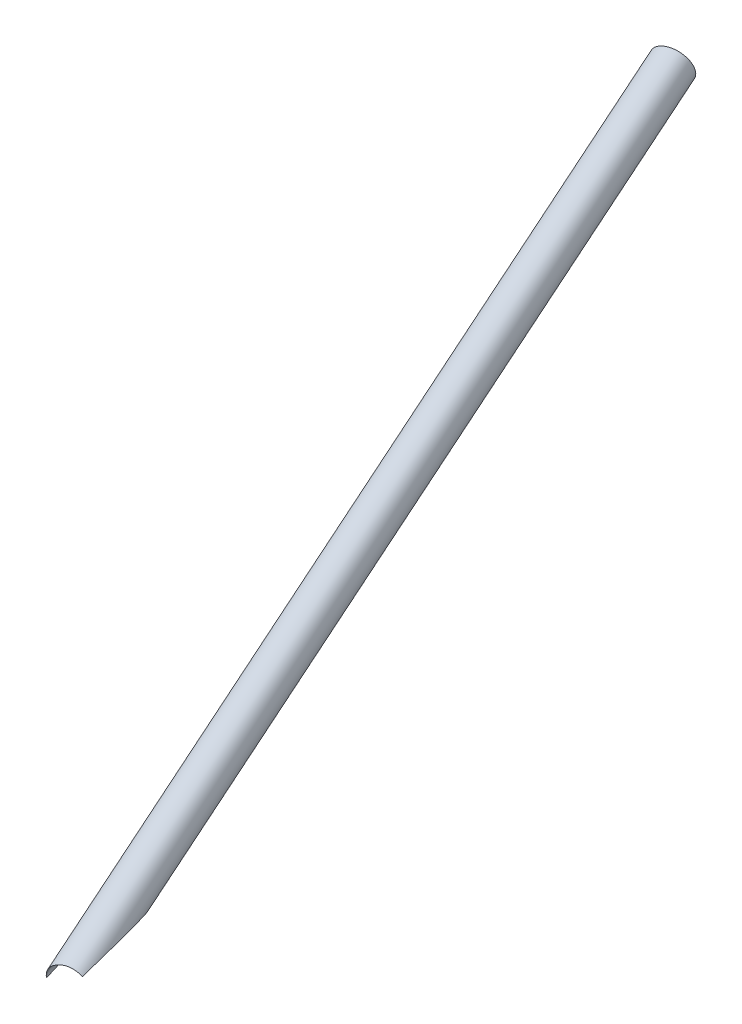
ISO-10303-21;
HEADER;
FILE_DESCRIPTION(('STEP AP214'),'2;1');
FILE_NAME('part.step','',(''),(''),'','','');
FILE_SCHEMA(('AUTOMOTIVE_DESIGN { 1 0 10303 214 1 1 1 1 }'));
ENDSEC;
DATA;
#1=APPLICATION_CONTEXT('core data for automotive mechanical design processes');
#2=APPLICATION_PROTOCOL_DEFINITION('international standard','automotive_design',2000,#1);
#3=PRODUCT_CONTEXT('',#1,'mechanical');
#4=PRODUCT('Part','Part','',(#3));
#5=PRODUCT_RELATED_PRODUCT_CATEGORY('part','',(#4));
#6=PRODUCT_DEFINITION_FORMATION('','',#4);
#7=PRODUCT_DEFINITION_CONTEXT('part definition',#1,'design');
#8=PRODUCT_DEFINITION('design','',#6,#7);
#9=PRODUCT_DEFINITION_SHAPE('','',#8);
#10=(LENGTH_UNIT() NAMED_UNIT(*) SI_UNIT(.MILLI.,.METRE.));
#11=(NAMED_UNIT(*) PLANE_ANGLE_UNIT() SI_UNIT($,.RADIAN.));
#12=(NAMED_UNIT(*) SI_UNIT($,.STERADIAN.) SOLID_ANGLE_UNIT());
#13=UNCERTAINTY_MEASURE_WITH_UNIT(LENGTH_MEASURE(1.E-05),#10,'distance_accuracy_value','');
#14=(GEOMETRIC_REPRESENTATION_CONTEXT(3) GLOBAL_UNCERTAINTY_ASSIGNED_CONTEXT((#13)) GLOBAL_UNIT_ASSIGNED_CONTEXT((#10,
#11,#12)) REPRESENTATION_CONTEXT('',''));
#15=CARTESIAN_POINT('',(0.,0.,0.));
#16=DIRECTION('',(0.,0.,1.));
#17=DIRECTION('',(1.,0.,0.));
#18=AXIS2_PLACEMENT_3D('',#15,#16,#17);
#19=CARTESIAN_POINT('',(-73.999999999997,1.84574577843932E-12,457.2));
#20=DIRECTION('',(0.,0.,-1.));
#21=DIRECTION('',(-1.,0.,0.));
#22=AXIS2_PLACEMENT_3D('',#19,#20,#21);
#23=CYLINDRICAL_SURFACE('',#22,9.52500000000001);
#24=CARTESIAN_POINT('',(-73.999999999997,1.85962356624714E-12,457.2));
#25=DIRECTION('',(0.863745042896464,0.478942715409445,-0.156711123498025));
#26=DIRECTION('',(0.137051802029359,0.0759946036802524,0.987644482479392));
#27=AXIS2_PLACEMENT_3D('',#24,#25,#26);
#28=ELLIPSE('',#27,60.7806248043446,9.525);
#29=CARTESIAN_POINT('',(-83.1702232239548,2.57538948953399,414.527401735599));
#30=VERTEX_POINT('',#29);
#31=CARTESIAN_POINT('',(-82.711415711536,3.85186465244711,420.957393255547));
#32=VERTEX_POINT('',#31);
#33=EDGE_CURVE('E11',#30,#32,#28,.T.);
#34=ORIENTED_EDGE('',*,*,#33,.F.);
#35=CARTESIAN_POINT('',(-73.999999999997,1.83186799063151E-12,457.2));
#36=DIRECTION('',(-0.705998161317946,0.681452623691267,0.192844284022027));
#37=DIRECTION('',(-0.138752175290532,0.133928158846875,-0.981229372837988));
#38=AXIS2_PLACEMENT_3D('',#35,#36,#37);
#39=ELLIPSE('',#38,49.3921821344324,9.525);
#40=CARTESIAN_POINT('',(-67.5903171408919,7.04567886336856,455.768419928183));
#41=VERTEX_POINT('',#40);
#42=EDGE_CURVE('E88',#30,#41,#39,.F.);
#43=ORIENTED_EDGE('',*,*,#42,.T.);
#44=CARTESIAN_POINT('',(-73.999999999997,1.85962356624714E-12,457.2));
#45=DIRECTION('',(0.137051802029359,0.0759946036802524,0.987644482479392));
#46=DIRECTION('',(0.863745042896464,0.478942715409445,-0.156711123498025));
#47=AXIS2_PLACEMENT_3D('',#44,#45,#46);
#48=ELLIPSE('',#47,9.64415857018543,9.525);
#49=CARTESIAN_POINT('',(-78.6189994934409,8.33009415790699,457.2));
#50=VERTEX_POINT('',#49);
#51=EDGE_CURVE('E80',#50,#41,#48,.F.);
#52=ORIENTED_EDGE('',*,*,#51,.F.);
#53=CARTESIAN_POINT('',(-79.5287224915516,7.75621380645265,450.431976644682));
#54=VERTEX_POINT('',#53);
#55=EDGE_CURVE('E47',#54,#50,#28,.T.);
#56=ORIENTED_EDGE('',*,*,#55,.F.);
#57=CARTESIAN_POINT('',(-83.0783311701916,2.88262522092037,448.840130336273));
#58=CARTESIAN_POINT('',(-83.1234487716692,2.74053719788143,448.686755174818));
#59=CARTESIAN_POINT('',(-83.162889555538,2.60477202412215,448.525795938173));
#60=CARTESIAN_POINT('',(-83.23223731539,2.34717784286664,448.191161979177));
#61=CARTESIAN_POINT('',(-83.2621396005952,2.22535571100804,448.017481052104));
#62=CARTESIAN_POINT('',(-83.314303284992,1.99581353750433,447.659471498606));
#63=CARTESIAN_POINT('',(-83.3365482130692,1.88812419962335,447.475120903578));
#64=CARTESIAN_POINT('',(-83.3750094588716,1.686803699881,447.098265150544));
#65=CARTESIAN_POINT('',(-83.3912231077153,1.59317877251446,446.905756424382));
#66=CARTESIAN_POINT('',(-83.4259805575389,1.37622117549353,446.417761868461));
#67=CARTESIAN_POINT('',(-83.4417120728853,1.26109132024384,446.11842690875));
#68=CARTESIAN_POINT('',(-83.4667319029019,1.05693507782309,445.510739214463));
#69=CARTESIAN_POINT('',(-83.47601590395,0.96792618947693,445.202380586192));
#70=CARTESIAN_POINT('',(-83.4906509303862,0.811975256151251,444.579280649329));
#71=CARTESIAN_POINT('',(-83.4959918506582,0.745090149001014,444.264525051086));
#72=CARTESIAN_POINT('',(-83.5022234937038,0.658911551290555,443.789943805115));
#73=CARTESIAN_POINT('',(-83.5040039961011,0.632545457764143,443.631358055174));
#74=CARTESIAN_POINT('',(-83.5071032005744,0.584131640215054,443.31351704729));
#75=CARTESIAN_POINT('',(-83.508421892063,0.562084015202501,443.154261774082));
#76=CARTESIAN_POINT('',(-83.5113103332794,0.51141552763474,442.75157194456));
#77=CARTESIAN_POINT('',(-83.5126488637894,0.485414164680476,442.507805809908));
#78=CARTESIAN_POINT('',(-83.5147884104922,0.441478911808157,442.019531686105));
#79=CARTESIAN_POINT('',(-83.5155893602502,0.423546019091538,441.775023609012));
#80=CARTESIAN_POINT('',(-83.516825799903,0.394789591359762,441.285488265026));
#81=CARTESIAN_POINT('',(-83.517261130002,0.383969165333725,441.040460817992));
#82=CARTESIAN_POINT('',(-83.5178661317586,0.36864636044065,440.550202948377));
#83=CARTESIAN_POINT('',(-83.5180357873151,0.364144364503791,440.304972514395));
#84=CARTESIAN_POINT('',(-83.5182328775336,0.359057816506341,439.568236032923));
#85=CARTESIAN_POINT('',(-83.5179465124179,0.366944314036851,439.076662659198));
#86=CARTESIAN_POINT('',(-83.5165685815542,0.400997867595029,438.094325864161));
#87=CARTESIAN_POINT('',(-83.5154771872083,0.42716103220006,437.603562292721));
#88=CARTESIAN_POINT('',(-83.5121917189946,0.494964778363646,436.620600244141));
#89=CARTESIAN_POINT('',(-83.5099920234461,0.536683982150881,436.128407300405));
#90=CARTESIAN_POINT('',(-83.5040368188595,0.633447295625621,435.145335883918));
#91=CARTESIAN_POINT('',(-83.5002812353461,0.688492043111358,434.654457475223));
#92=CARTESIAN_POINT('',(-83.4906628376773,0.810355253769585,433.674827766196));
#93=CARTESIAN_POINT('',(-83.4848027102563,0.877158650247711,433.186074554308));
#94=CARTESIAN_POINT('',(-83.4703323873961,1.02161817737519,432.210231899026));
#95=CARTESIAN_POINT('',(-83.4617222693841,1.099274002435,431.723142409179));
#96=CARTESIAN_POINT('',(-83.442920668422,1.2496009664048,430.840556971683));
#97=CARTESIAN_POINT('',(-83.4333146096642,1.32054551143146,430.444753259625));
#98=CARTESIAN_POINT('',(-83.4113131771563,1.46916837717677,429.654489322462));
#99=CARTESIAN_POINT('',(-83.3989178155323,1.54684666862077,429.260029091524));
#100=CARTESIAN_POINT('',(-83.3707866907269,1.7090238377622,428.472367171137));
#101=CARTESIAN_POINT('',(-83.3550487955021,1.79352704732899,428.079166448336));
#102=CARTESIAN_POINT('',(-83.3195868730682,1.96951462809067,427.294512492263));
#103=CARTESIAN_POINT('',(-83.2998629072026,2.06099889183728,426.903059232194));
#104=CARTESIAN_POINT('',(-83.2557268871279,2.25091339037423,426.124008815827));
#105=CARTESIAN_POINT('',(-83.2313367667321,2.34930981585192,425.736402207194));
#106=CARTESIAN_POINT('',(-83.1768013551106,2.55405136989546,424.963705092786));
#107=CARTESIAN_POINT('',(-83.1466563018017,2.66039616975396,424.578614483676));
#108=CARTESIAN_POINT('',(-83.0792939215011,2.88191728689083,423.811933399232));
#109=CARTESIAN_POINT('',(-83.0420824232586,2.99708627916523,423.430340309011));
#110=CARTESIAN_POINT('',(-82.9587302071265,3.23775490727663,422.671442730623));
#111=CARTESIAN_POINT('',(-82.9125912910689,3.36325245555588,422.294137393296));
#112=CARTESIAN_POINT('',(-82.8247650370522,3.5858957528778,421.661848424497));
#113=CARTESIAN_POINT('',(-82.7861481046395,3.6797365598048,421.405280167797));
#114=CARTESIAN_POINT('',(-82.701998753157,3.87454828371765,420.89586853873));
#115=CARTESIAN_POINT('',(-82.6564635643781,3.97552204766603,420.6430267029));
#116=CARTESIAN_POINT('',(-82.5565136088001,4.18633541144703,420.142099666318));
#117=CARTESIAN_POINT('',(-82.502080151092,4.29619342185892,419.894025733567));
#118=CARTESIAN_POINT('',(-82.4116705783791,4.46918484450631,419.528059581679));
#119=CARTESIAN_POINT('',(-82.3800854359944,4.52819625768236,419.407131958362));
#120=CARTESIAN_POINT('',(-82.3134662543212,4.64937596841508,419.167845213593));
#121=CARTESIAN_POINT('',(-82.2784327872383,4.71154374138779,419.049485669965));
#122=CARTESIAN_POINT('',(-82.2039065572505,4.84015716910135,418.814935065727));
#123=CARTESIAN_POINT('',(-82.1643741706711,4.90663819724155,418.698775781159));
#124=CARTESIAN_POINT('',(-82.0802587708642,5.04395980601701,418.470982279816));
#125=CARTESIAN_POINT('',(-82.0356780639519,5.11479838920925,418.359346028099));
#126=CARTESIAN_POINT('',(-81.9405487729902,5.26126426463709,418.142868590203));
#127=CARTESIAN_POINT('',(-81.8900348210484,5.33686267916955,418.03799301221));
#128=CARTESIAN_POINT('',(-81.7813926637874,5.49405882184116,417.837156582913));
#129=CARTESIAN_POINT('',(-81.7232769597262,5.57564660571742,417.741181527947));
#130=CARTESIAN_POINT('',(-81.6131555062434,5.72466502523623,417.584631696568));
#131=CARTESIAN_POINT('',(-81.5632199740093,5.79057575482752,417.521186499845));
#132=CARTESIAN_POINT('',(-81.4571037857485,5.92660710420791,417.404534675451));
#133=CARTESIAN_POINT('',(-81.4009190197575,5.99673048044227,417.351334849468));
#134=CARTESIAN_POINT('',(-81.2810540644931,6.14172771260025,417.258469019333));
#135=CARTESIAN_POINT('',(-81.2172842750836,6.21665227340748,417.21899205081));
#136=CARTESIAN_POINT('',(-81.0835717997546,6.36857779911607,417.15931014802));
#137=CARTESIAN_POINT('',(-81.013645986455,6.4455727100741,417.139054225057));
#138=CARTESIAN_POINT('',(-80.8769944232635,6.59101869011532,417.121816468254));
#139=CARTESIAN_POINT('',(-80.810635640342,6.65956195979228,417.122731871491));
#140=CARTESIAN_POINT('',(-80.6772245591758,6.79332350361357,417.142564031167));
#141=CARTESIAN_POINT('',(-80.6101716339296,6.85853838517595,417.161498783069));
#142=CARTESIAN_POINT('',(-80.4682431594539,6.99273377873001,417.218722715104));
#143=CARTESIAN_POINT('',(-80.393609066961,7.06093373575141,417.259378690443));
#144=CARTESIAN_POINT('',(-80.2480966515137,7.19002331054364,417.356036903216));
#145=CARTESIAN_POINT('',(-80.177225774637,7.25089871623214,417.412068304766));
#146=CARTESIAN_POINT('',(-80.050147102575,7.35711401863949,417.525819986066));
#147=CARTESIAN_POINT('',(-79.993339004505,7.40341264355699,417.582013497657));
#148=CARTESIAN_POINT('',(-79.8826441180493,7.49167127320923,417.700420008276));
#149=CARTESIAN_POINT('',(-79.8287596272122,7.5336278885651,417.762637637498));
#150=CARTESIAN_POINT('',(-79.7236006362022,7.61382973196948,417.891766973748));
#151=CARTESIAN_POINT('',(-79.6723325448019,7.65206603697196,417.958689333997));
#152=CARTESIAN_POINT('',(-79.5722834426023,7.72522602998581,418.096043436717));
#153=CARTESIAN_POINT('',(-79.5235016681045,7.76015073805981,418.166474088273));
#154=CARTESIAN_POINT('',(-79.4048199303915,7.84353824049797,418.345232528438));
#155=CARTESIAN_POINT('',(-79.3362569166114,7.89027070565841,418.455251737924));
#156=CARTESIAN_POINT('',(-79.2032351789502,7.97861729526743,418.679766191636));
#157=CARTESIAN_POINT('',(-79.1387786344105,8.02022871266431,418.794263761398));
#158=CARTESIAN_POINT('',(-79.0132851460382,8.09926572772723,419.026792953078));
#159=CARTESIAN_POINT('',(-78.9522543239081,8.13668394407553,419.144830357319));
#160=CARTESIAN_POINT('',(-78.8332455573321,8.20793266434091,419.383507604836));
#161=CARTESIAN_POINT('',(-78.7752681719019,8.24176251244994,419.504147918987));
#162=CARTESIAN_POINT('',(-78.6046912047835,8.33904857208041,419.870479690505));
#163=CARTESIAN_POINT('',(-78.4961280924819,8.39787908247427,420.119289602075));
#164=CARTESIAN_POINT('',(-78.3397188586092,8.47914283471997,420.496393053358));
#165=CARTESIAN_POINT('',(-78.2886807171135,8.50505503243724,420.622673408925));
#166=CARTESIAN_POINT('',(-78.1885223526299,8.55482562726834,420.876397387296));
#167=CARTESIAN_POINT('',(-78.1394021021532,8.57868405382448,421.003840993396));
#168=CARTESIAN_POINT('',(-77.9967340790464,8.64654223332614,421.382102043801));
#169=CARTESIAN_POINT('',(-77.9056404463939,8.687974473764,421.63430672));
#170=CARTESIAN_POINT('',(-77.7290865170786,8.76520415409009,422.141550654267));
#171=CARTESIAN_POINT('',(-77.6436270365902,8.8010007786298,422.396590316792));
#172=CARTESIAN_POINT('',(-77.4775898850125,8.86792022853603,422.90899201162));
#173=CARTESIAN_POINT('',(-77.3970145664416,8.89904081213377,423.166355095529));
#174=CARTESIAN_POINT('',(-77.2402536654399,8.95730737057692,423.68286700779));
#175=CARTESIAN_POINT('',(-77.1640683144944,8.98445313594421,423.942015929506));
#176=CARTESIAN_POINT('',(-76.9411277004219,9.06091734251955,424.722844784751));
#177=CARTESIAN_POINT('',(-76.800359950432,9.10511665701469,425.246743012463));
#178=CARTESIAN_POINT('',(-76.532644776595,9.18317360320125,426.298618191083));
#179=CARTESIAN_POINT('',(-76.4056937376907,9.21703394422783,426.826594036201));
#180=CARTESIAN_POINT('',(-76.164460712395,9.27664574156181,427.885660443402));
#181=CARTESIAN_POINT('',(-76.0501738322539,9.30240033726302,428.416749718257));
#182=CARTESIAN_POINT('',(-75.8337106138622,9.34747745438075,429.481693728701));
#183=CARTESIAN_POINT('',(-75.7315351815848,9.36679949481782,430.015548668056));
#184=CARTESIAN_POINT('',(-75.5394859935606,9.40027061511069,431.084895566942));
#185=CARTESIAN_POINT('',(-75.449596107396,9.41442651950749,431.620384417615));
#186=CARTESIAN_POINT('',(-75.2825336682031,9.43863601481442,432.693404494247));
#187=CARTESIAN_POINT('',(-75.2053603351224,9.44868985740708,433.23093559286));
#188=CARTESIAN_POINT('',(-75.0586080341147,9.46630383676574,434.355729566868));
#189=CARTESIAN_POINT('',(-74.990313901412,9.47356286982195,434.943165851078));
#190=CARTESIAN_POINT('',(-74.8724891762731,9.4851413241368,436.120173678952));
#191=CARTESIAN_POINT('',(-74.8229641824305,9.48945986859095,436.709745806852));
#192=CARTESIAN_POINT('',(-74.7656277252589,9.49419800089484,437.594952047904));
#193=CARTESIAN_POINT('',(-74.7493439283461,9.49548725967502,437.890041876255));
#194=CARTESIAN_POINT('',(-74.7230707923568,9.49752447867106,438.480499261229));
#195=CARTESIAN_POINT('',(-74.713081208585,9.49827245992991,438.775866806608));
#196=CARTESIAN_POINT('',(-74.7001739300856,9.49923290029793,439.366686122153));
#197=CARTESIAN_POINT('',(-74.6972543545899,9.49944550182975,439.662137849003));
#198=CARTESIAN_POINT('',(-74.6994463773867,9.49928411549574,440.253000426126));
#199=CARTESIAN_POINT('',(-74.7045575488969,9.49891015880169,440.548411277737));
#200=CARTESIAN_POINT('',(-74.726559887372,9.4972584676239,441.217393468292));
#201=CARTESIAN_POINT('',(-74.7462194868119,9.49576705242713,441.590883004393));
#202=CARTESIAN_POINT('',(-74.8032794024316,9.49111139569498,442.336612131186));
#203=CARTESIAN_POINT('',(-74.8406834522403,9.4879468020883,442.708851442209));
#204=CARTESIAN_POINT('',(-74.9370456961787,9.47892375850038,443.450166846554));
#205=CARTESIAN_POINT('',(-74.9959768616247,9.4730686842239,443.819246315116));
#206=CARTESIAN_POINT('',(-75.1041362370958,9.46085460183102,444.368807011265));
#207=CARTESIAN_POINT('',(-75.143474987338,9.45621238142459,444.551287622536));
#208=CARTESIAN_POINT('',(-75.2294396685636,9.4454218345095,444.914469708737));
#209=CARTESIAN_POINT('',(-75.2760647012818,9.43927369360033,445.09517140006));
#210=CARTESIAN_POINT('',(-75.3863874139026,9.42375724288128,445.486367354667));
#211=CARTESIAN_POINT('',(-75.451647107752,9.41400971740626,445.696411526769));
#212=CARTESIAN_POINT('',(-75.5945084049,9.39086828248109,446.112021359327));
#213=CARTESIAN_POINT('',(-75.6721062078306,9.37747549493845,446.317588376736));
#214=CARTESIAN_POINT('',(-75.8407006134923,9.34584387520662,446.722516611415));
#215=CARTESIAN_POINT('',(-75.9316805215902,9.32761105863514,446.921885191371));
#216=CARTESIAN_POINT('',(-76.1280101429176,9.28478834903117,447.312728502373));
#217=CARTESIAN_POINT('',(-76.2333562636446,9.26020004391878,447.504205191374));
#218=CARTESIAN_POINT('',(-76.4354350983799,9.20884113682913,447.838278271645));
#219=CARTESIAN_POINT('',(-76.5294169752635,9.18358285670173,447.982771043582));
#220=CARTESIAN_POINT('',(-76.7266123003188,9.12697847430928,448.264151962718));
#221=CARTESIAN_POINT('',(-76.8298278477702,9.09563098575246,448.40103836908));
#222=CARTESIAN_POINT('',(-77.045018783252,9.02586666385931,448.665824967481));
#223=CARTESIAN_POINT('',(-77.1569927983265,8.98745093725092,448.793726562014));
#224=CARTESIAN_POINT('',(-77.3888377657914,8.90261899695821,449.039217028472));
#225=CARTESIAN_POINT('',(-77.5087047756346,8.85620675907801,449.156810981648));
#226=CARTESIAN_POINT('',(-77.7561907917189,8.75412524838747,449.38148732453));
#227=CARTESIAN_POINT('',(-77.8838649060808,8.69838377299784,449.488476467154));
#228=CARTESIAN_POINT('',(-78.1445145080344,8.57725294423057,449.689823955692));
#229=CARTESIAN_POINT('',(-78.2774901698279,8.5118632736351,449.784181886117));
#230=CARTESIAN_POINT('',(-78.5469248647565,8.37103337647312,449.959458415068));
#231=CARTESIAN_POINT('',(-78.683383646686,8.29559387306297,450.040377979639));
#232=CARTESIAN_POINT('',(-78.9578582859466,8.13452949838608,450.188214239413));
#233=CARTESIAN_POINT('',(-79.0958739540871,8.04890585286734,450.255132617108));
#234=CARTESIAN_POINT('',(-79.3540187739953,7.87914098401011,450.36702637315));
#235=CARTESIAN_POINT('',(-79.4741953625806,7.79619026855331,450.413708636146));
#236=CARTESIAN_POINT('',(-79.7130162110765,7.62291467327685,450.495992955028));
#237=CARTESIAN_POINT('',(-79.8316605427597,7.53259014031706,450.531595531717));
#238=CARTESIAN_POINT('',(-80.066219058077,7.34500916227413,450.59163485768));
#239=CARTESIAN_POINT('',(-80.1821338167684,7.2477541949734,450.616073979159));
#240=CARTESIAN_POINT('',(-80.4101889431571,7.04685694033999,450.653760655659));
#241=CARTESIAN_POINT('',(-80.522329312932,6.94321465652324,450.667008216841));
#242=CARTESIAN_POINT('',(-80.7379818981115,6.73401736033233,450.682025904741));
#243=CARTESIAN_POINT('',(-80.8416590270088,6.62866002844907,450.684185833325));
#244=CARTESIAN_POINT('',(-81.0438500775632,6.41339260550491,450.678077436157));
#245=CARTESIAN_POINT('',(-81.1423640747331,6.30348258107101,450.669809262964));
#246=CARTESIAN_POINT('',(-81.3335715279093,6.07996558284151,450.642854339259));
#247=CARTESIAN_POINT('',(-81.4262657307077,5.96635908622681,450.624168928531));
#248=CARTESIAN_POINT('',(-81.6053197728077,5.73637295592533,450.576403535136));
#249=CARTESIAN_POINT('',(-81.6916795960189,5.61999331519524,450.547323526066));
#250=CARTESIAN_POINT('',(-81.8574916124417,5.38572223674966,450.478888327461));
#251=CARTESIAN_POINT('',(-81.9369573618506,5.26783431419828,450.439553941417));
#252=CARTESIAN_POINT('',(-82.0889011373176,5.03140640368183,450.35067679644));
#253=CARTESIAN_POINT('',(-82.1613791632038,4.91286641570071,450.301134037256));
#254=CARTESIAN_POINT('',(-82.2991907215227,4.67630138620081,450.192013578676));
#255=CARTESIAN_POINT('',(-82.3645259893996,4.55827622631737,450.132438325806));
#256=CARTESIAN_POINT('',(-82.4880711815792,4.32386701688578,450.00349119323));
#257=CARTESIAN_POINT('',(-82.5462813318609,4.20748291539375,449.934119624373));
#258=CARTESIAN_POINT('',(-82.652332008558,3.98460231672964,449.790518645449));
#259=CARTESIAN_POINT('',(-82.7005912056635,3.87793947233799,449.716855016997));
#260=CARTESIAN_POINT('',(-82.791202706913,3.66789684463995,449.56157644578));
#261=CARTESIAN_POINT('',(-82.8335533137856,3.56451801124083,449.479959229696));
#262=CARTESIAN_POINT('',(-82.912635415895,3.36190138043082,449.309290350869));
#263=CARTESIAN_POINT('',(-82.9493688681181,3.26266214960756,449.22024129413));
#264=CARTESIAN_POINT('',(-83.0176365002781,3.06894255188561,449.035228657452));
#265=CARTESIAN_POINT('',(-83.0491696156696,2.97446316210208,448.939263667536));
#266=CARTESIAN_POINT('',(-83.0783311701916,2.88262522092037,448.840130336273));
#267=B_SPLINE_CURVE_WITH_KNOTS('',3,(#57,#58,#59,#60,#61,#62,#63,#64,#65,#66,#67,#68,#69,#70,
#71,#72,#73,#74,#75,#76,#77,#78,#79,#80,#81,#82,#83,#84,#85,#86,#87,#88,#89,#90,#91,#92,#93,#94,
#95,#96,#97,#98,#99,#100,#101,#102,#103,#104,#105,#106,#107,#108,#109,#110,#111,#112,#113,#114,
#115,#116,#117,#118,#119,#120,#121,#122,#123,#124,#125,#126,#127,#128,#129,#130,#131,#132,#133,
#134,#135,#136,#137,#138,#139,#140,#141,#142,#143,#144,#145,#146,#147,#148,#149,#150,#151,#152,
#153,#154,#155,#156,#157,#158,#159,#160,#161,#162,#163,#164,#165,#166,#167,#168,#169,#170,#171,
#172,#173,#174,#175,#176,#177,#178,#179,#180,#181,#182,#183,#184,#185,#186,#187,#188,#189,#190,
#191,#192,#193,#194,#195,#196,#197,#198,#199,#200,#201,#202,#203,#204,#205,#206,#207,#208,#209,
#210,#211,#212,#213,#214,#215,#216,#217,#218,#219,#220,#221,#222,#223,#224,#225,#226,#227,#228,
#229,#230,#231,#232,#233,#234,#235,#236,#237,#238,#239,#240,#241,#242,#243,#244,#245,#246,#247,
#248,#249,#250,#251,#252,#253,#254,#255,#256,#257,#258,#259,#260,#261,#262,#263,#264,#265,#266),
.UNSPECIFIED.,.T.,.F.,(4,2,2,2,2,2,2,2,2,2,2,2,2,2,2,2,2,2,2,2,2,2,2,2,2,2,2,2,2,2,2,2,2,2,2,2,
2,2,2,2,2,2,2,2,2,2,2,2,2,2,2,2,2,2,2,2,2,2,2,2,2,2,2,2,2,2,2,2,2,2,2,2,2,2,2,2,2,2,2,2,2,2,2,2,
2,2,2,2,2,2,2,2,2,2,2,2,2,2,2,2,2,2,2,2,4),(0.,0.641483858396455,1.28328269674685,
1.9264535535847,2.56990868023558,3.53154383418783,4.49382173890908,5.45855723789898,
5.94082858763,6.42311099316905,7.15840456906585,7.89378899669874,8.62949466091078,
9.3652449108402,10.8396800080995,12.3138012679403,13.7954762030836,15.2772220694084,
16.7570829725999,18.2369022133246,19.4435170244813,20.6501265902033,21.8575081187726,
23.0648710677835,24.2666922354423,25.4684637289054,26.6692482147052,27.869790596981,
28.6973485465262,29.525238684421,30.3548907029034,30.7694567157016,31.1839540521419,
31.6024352834199,32.0207260978409,32.4366865199569,32.8519712893872,33.1640620712172,
33.4763593347314,33.7928023229639,34.1084034996874,34.392806740666,34.6774943062826,
35.0026129392656,35.3283525717731,35.6050075619154,35.8818769057351,36.1593947375255,
36.4368268066175,36.8499126921122,37.2632160106474,37.6772358053759,38.0913311362141,
38.9240742447336,39.3399990900787,39.755917971846,40.5697415681667,41.383682798706,
42.1980130090986,43.0123861203234,44.644820992954,46.2768277170357,47.9082015770688,
49.5396973919262,51.1690301081252,52.7982628413672,54.5723174802078,56.3469008810643,
57.2334712881841,58.1200072266618,59.0063073023645,59.8925602785293,61.0142240327065,
62.1361239020969,63.2566199683625,63.8166826219885,64.3766762845338,65.0367979582937,
65.6967166947484,66.3558190350023,67.0147568573166,67.5369217284992,68.0592056172966,
68.5814077976089,69.1033510883106,69.6295384280908,70.1557430719586,70.6819098721225,
71.2080134076047,71.6673601866559,72.1266853707511,72.5859129039369,73.0451401843398,
73.4881063746869,73.9310660846728,74.3739688377069,74.8168727157583,75.2588849552113,
75.7008972055331,76.142801822296,76.5846924200549,76.9992537752819,77.4139339711576,
77.8284693639012,78.2430895098954),.UNSPECIFIED.);
#268=EDGE_CURVE('E79',#32,#54,#267,.T.);
#269=ORIENTED_EDGE('',*,*,#268,.F.);
#270=EDGE_LOOP('',(#34,#43,#52,#56,#269));
#271=FACE_BOUND('',#270,.T.);
#272=ADVANCED_FACE('F36',(#271),#23,.F.);
#273=CARTESIAN_POINT('',(-204.165057136813,-72.1759348192332,1.52655665885959E-12));
#274=DIRECTION('',(0.270716912176299,0.150111302046013,0.950883247543978));
#275=DIRECTION('',(0.961781089140043,0.,-0.273819532854383));
#276=AXIS2_PLACEMENT_3D('',#273,#274,#275);
#277=CYLINDRICAL_SURFACE('',#276,9.52499999999999);
#278=CARTESIAN_POINT('',(-73.999999999997,1.80411241501588E-12,457.2));
#279=DIRECTION('',(-0.277508363855048,0.057604513973683,-0.958994696523578));
#280=DIRECTION('',(-0.00381544954876784,0.998126854994749,0.0610591818077524));
#281=AXIS2_PLACEMENT_3D('',#278,#279,#280);
#282=ELLIPSE('',#281,9.73556956140376,9.52499999999999);
#283=CARTESIAN_POINT('',(-78.3709263667502,8.46289712193484,458.973179462046));
#284=VERTEX_POINT('',#283);
#285=EDGE_CURVE('E89',#41,#284,#282,.F.);
#286=ORIENTED_EDGE('',*,*,#285,.T.);
#287=CARTESIAN_POINT('',(-73.999999999997,1.85962356624714E-12,457.2));
#288=DIRECTION('',(0.863745042896464,0.478942715409445,-0.156711123498025));
#289=DIRECTION('',(0.137051802029359,0.0759946036802524,0.987644482479392));
#290=AXIS2_PLACEMENT_3D('',#287,#288,#289);
#291=ELLIPSE('',#290,60.7806248043446,9.525);
#292=EDGE_CURVE('E70',#284,#50,#291,.F.);
#293=ORIENTED_EDGE('',*,*,#292,.T.);
#294=ORIENTED_EDGE('',*,*,#51,.T.);
#295=EDGE_LOOP('',(#286,#293,#294));
#296=FACE_BOUND('',#295,.T.);
#297=ADVANCED_FACE('F115',(#296),#277,.F.);
#298=CARTESIAN_POINT('',(-73.999999999997,1.83186799063151E-12,457.2));
#299=DIRECTION('',(-0.138752175290532,0.133928158846875,-0.981229372837988));
#300=DIRECTION('',(-0.705998161317946,0.681452623691267,0.192844284022027));
#301=AXIS2_PLACEMENT_3D('',#298,#299,#300);
#302=ELLIPSE('',#301,9.70721042772196,9.525);
#303=CARTESIAN_POINT('',(-83.524271376681,-0.117812322265612,458.530713307516));
#304=VERTEX_POINT('',#303);
#305=EDGE_CURVE('E73',#284,#304,#302,.F.);
#306=ORIENTED_EDGE('',*,*,#305,.T.);
#307=CARTESIAN_POINT('',(-73.999999999997,1.85962356624714E-12,457.2));
#308=DIRECTION('',(0.137051802029359,0.0759946036802524,0.987644482479392));
#309=DIRECTION('',(0.863745042896464,0.478942715409445,-0.156711123498025));
#310=AXIS2_PLACEMENT_3D('',#307,#308,#309);
#311=ELLIPSE('',#310,9.64415857018543,9.525);
#312=EDGE_CURVE('E75',#50,#304,#311,.T.);
#313=ORIENTED_EDGE('',*,*,#312,.F.);
#314=ORIENTED_EDGE('',*,*,#292,.F.);
#315=EDGE_LOOP('',(#306,#313,#314));
#316=FACE_BOUND('',#315,.T.);
#317=ADVANCED_FACE('F74',(#316),#23,.F.);
#318=CARTESIAN_POINT('',(-73.9999999999971,1.81799020282369E-12,457.2));
#319=DIRECTION('',(-0.27229541988046,0.262828486621337,-0.925622164240065));
#320=DIRECTION('',(-0.959350460020582,0.,0.282217460229339));
#321=AXIS2_PLACEMENT_3D('',#318,#319,#320);
#322=CYLINDRICAL_SURFACE('',#321,6.35);
#323=CARTESIAN_POINT('',(-205.569535884328,126.995239277737,9.95164522862818));
#324=DIRECTION('',(0.272295419880458,-0.262828486621336,0.925622164240066));
#325=DIRECTION('',(0.959350460020582,0.,-0.282217460229338));
#326=AXIS2_PLACEMENT_3D('',#323,#324,#325);
#327=CIRCLE('',#326,6.34999999999997);
#328=CARTESIAN_POINT('',(-199.477660463198,126.995239277737,8.15956435617189));
#329=VERTEX_POINT('',#328);
#330=EDGE_CURVE('E92',#329,#329,#327,.F.);
#331=ORIENTED_EDGE('',*,*,#330,.T.);
#332=EDGE_LOOP('',(#331));
#333=FACE_BOUND('',#332,.T.);
#334=ORIENTED_EDGE('',*,*,#268,.T.);
#335=CARTESIAN_POINT('',(-84.7853341524226,4.53028058976519,443.037462794268));
#336=CARTESIAN_POINT('',(-84.8598425095708,4.48802052439217,442.784188395604));
#337=CARTESIAN_POINT('',(-84.9317273025632,4.44838592376756,442.529697242522));
#338=CARTESIAN_POINT('',(-85.0708063874522,4.37378043890944,442.018750943184));
#339=CARTESIAN_POINT('',(-85.1380002910922,4.33880994049768,441.762295636303));
#340=CARTESIAN_POINT('',(-85.3332635391341,4.24008072699981,440.990385155996));
#341=CARTESIAN_POINT('',(-85.454976428813,4.18252556106809,440.472516652739));
#342=CARTESIAN_POINT('',(-85.6840053531375,4.08048508435118,439.431609848243));
#343=CARTESIAN_POINT('',(-85.7913002821043,4.03601882283559,438.908565146));
#344=CARTESIAN_POINT('',(-85.9925574872025,3.95770628354352,437.859218272234));
#345=CARTESIAN_POINT('',(-86.0865216225681,3.92385852401461,437.33291656567));
#346=CARTESIAN_POINT('',(-86.2621528958099,3.86464311133139,436.274644978908));
#347=CARTESIAN_POINT('',(-86.3437452466383,3.8393259825803,435.742659938267));
#348=CARTESIAN_POINT('',(-86.4938359393774,3.79591334421023,434.676523104526));
#349=CARTESIAN_POINT('',(-86.5623335076645,3.77781826119213,434.142371185313));
#350=CARTESIAN_POINT('',(-86.685390089983,3.74768318892197,433.072903232835));
#351=CARTESIAN_POINT('',(-86.7399648659392,3.73563633739998,432.537589214107));
#352=CARTESIAN_POINT('',(-86.8337912782966,3.71664486251841,431.465572761353));
#353=CARTESIAN_POINT('',(-86.873044392442,3.70969974704945,430.928870466252));
#354=CARTESIAN_POINT('',(-86.933590253123,3.70022412523554,429.858800063859));
#355=CARTESIAN_POINT('',(-86.9550283593378,3.69765770625877,429.325440933666));
#356=CARTESIAN_POINT('',(-86.9712576988082,3.69662270481312,428.524879514196));
#357=CARTESIAN_POINT('',(-86.9740107595125,3.69674742050352,428.257832019087));
#358=CARTESIAN_POINT('',(-86.9734933794999,3.69788095851156,427.723742214036));
#359=CARTESIAN_POINT('',(-86.9702230738294,3.69888976100732,427.456699904112));
#360=CARTESIAN_POINT('',(-86.9568131689872,3.70173480749539,426.923971283731));
#361=CARTESIAN_POINT('',(-86.9467041317003,3.70356735803285,426.658284216672));
#362=CARTESIAN_POINT('',(-86.9184950608588,3.70801662817218,426.127344620803));
#363=CARTESIAN_POINT('',(-86.9003955856894,3.71063329297473,425.862092062928));
#364=CARTESIAN_POINT('',(-86.8546624714844,3.7166119454784,425.332706539174));
#365=CARTESIAN_POINT('',(-86.8270397241947,3.71997308016754,425.06857264172));
#366=CARTESIAN_POINT('',(-86.7600836070985,3.72741287753519,424.541832957931));
#367=CARTESIAN_POINT('',(-86.7207541759694,3.73149129869637,424.279226687879));
#368=CARTESIAN_POINT('',(-86.6456921144131,3.73858776476274,423.860307337359));
#369=CARTESIAN_POINT('',(-86.6147178457559,3.74138495882267,423.703139195244));
#370=CARTESIAN_POINT('',(-86.546286863922,3.74722903645102,423.390164641572));
#371=CARTESIAN_POINT('',(-86.5088285663887,3.75027598094932,423.234358572631));
#372=CARTESIAN_POINT('',(-86.426176596342,3.75660949837066,422.925034576125));
#373=CARTESIAN_POINT('',(-86.3809943643942,3.75989571281632,422.771513624327));
#374=CARTESIAN_POINT('',(-86.2810916107984,3.76670329194033,422.46764993685));
#375=CARTESIAN_POINT('',(-86.2263763756279,3.77022452562578,422.317305491196));
#376=CARTESIAN_POINT('',(-86.1040305970798,3.77754521324716,422.019231153146));
#377=CARTESIAN_POINT('',(-86.0362177925774,3.78134806109041,421.871574839982));
#378=CARTESIAN_POINT('',(-85.8846548775586,3.78915460266937,421.584411818584));
#379=CARTESIAN_POINT('',(-85.800908094513,3.79315825434318,421.444903416766));
#380=CARTESIAN_POINT('',(-85.6348471669861,3.80033757634651,421.210971186338));
#381=CARTESIAN_POINT('',(-85.5567347194405,3.80348911633566,421.113610586933));
#382=CARTESIAN_POINT('',(-85.3864427333155,3.80977934906003,420.9320261448));
#383=CARTESIAN_POINT('',(-85.2942962878064,3.81291805463348,420.847772316318));
#384=CARTESIAN_POINT('',(-85.1200853538915,3.81827972058145,420.717335123006));
#385=CARTESIAN_POINT('',(-85.0412362003686,3.82053587119264,420.666897408387));
#386=CARTESIAN_POINT('',(-84.8761978497,3.82487987395261,420.579955750408));
#387=CARTESIAN_POINT('',(-84.7900171518332,3.82696791566207,420.543435934522));
#388=CARTESIAN_POINT('',(-84.6122685621727,3.83090288765979,420.486227274774));
#389=CARTESIAN_POINT('',(-84.5206865422227,3.83274914089403,420.46558212845));
#390=CARTESIAN_POINT('',(-84.3353190091582,3.83614642411785,420.440437122383));
#391=CARTESIAN_POINT('',(-84.2415314543136,3.83769716740299,420.435952867198));
#392=CARTESIAN_POINT('',(-84.0288650484642,3.84088306464685,420.442337865944));
#393=CARTESIAN_POINT('',(-83.9101407591897,3.84242526180405,420.457742763384));
#394=CARTESIAN_POINT('',(-83.6766435374558,3.84509657049996,420.507147279301));
#395=CARTESIAN_POINT('',(-83.5618801389075,3.84622474082706,420.541188832634));
#396=CARTESIAN_POINT('',(-83.3529714432103,3.84802840974654,420.617486729373));
#397=CARTESIAN_POINT('',(-83.2581581411608,3.84874478511961,420.657974386476));
#398=CARTESIAN_POINT('',(-83.0723280953055,3.84999582859283,420.746970752533));
#399=CARTESIAN_POINT('',(-82.9813144820675,3.85053034935726,420.795485918176));
#400=CARTESIAN_POINT('',(-82.8027373017713,3.85146408830547,420.898875441432));
#401=CARTESIAN_POINT('',(-82.7151820860296,3.85186299479003,420.953764064993));
#402=CARTESIAN_POINT('',(-82.5434529144788,3.85256059715051,421.068500168046));
#403=CARTESIAN_POINT('',(-82.4592778631165,3.8528593257299,421.12834602126));
#404=CARTESIAN_POINT('',(-82.2521109176286,3.85351991282209,421.283342562881));
#405=CARTESIAN_POINT('',(-82.1310256313351,3.85383724999712,421.381036936632));
#406=CARTESIAN_POINT('',(-81.8946443366284,3.85438926373824,421.583237091317));
#407=CARTESIAN_POINT('',(-81.7793514280902,3.85462389643951,421.687746452073));
#408=CARTESIAN_POINT('',(-81.5535764562079,3.85506654345587,421.902205630303));
#409=CARTESIAN_POINT('',(-81.4431033063989,3.85527450972603,422.01216478604));
#410=CARTESIAN_POINT('',(-81.2264994678798,3.85570667355178,422.236284787091));
#411=CARTESIAN_POINT('',(-81.1203692950644,3.85593087302698,422.350446128534));
#412=CARTESIAN_POINT('',(-80.9113136695376,3.85643144166148,422.582857159074));
#413=CARTESIAN_POINT('',(-80.808410399668,3.85670810614496,422.701126735927));
#414=CARTESIAN_POINT('',(-80.6060054366357,3.85734181470107,422.940540504506));
#415=CARTESIAN_POINT('',(-80.5065038634453,3.8576988616053,423.061684797364));
#416=CARTESIAN_POINT('',(-80.3106555266462,3.85851771323894,423.306253585915));
#417=CARTESIAN_POINT('',(-80.2143051207725,3.85897939175294,423.429675171115));
#418=CARTESIAN_POINT('',(-80.0243360296872,3.86002955027711,423.678595479775));
#419=CARTESIAN_POINT('',(-79.9307173192712,3.86061802911691,423.804094184055));
#420=CARTESIAN_POINT('',(-79.6662558178038,3.86251285151169,424.165934197714));
#421=CARTESIAN_POINT('',(-79.4984605904334,3.86400054576027,424.404505710897));
#422=CARTESIAN_POINT('',(-79.1701495003744,3.86760245077541,424.886617851865));
#423=CARTESIAN_POINT('',(-79.0096345909659,3.86971674331686,425.130159124368));
#424=CARTESIAN_POINT('',(-78.6948917466294,3.87468159370704,425.621405748471));
#425=CARTESIAN_POINT('',(-78.5406665734012,3.87753247103027,425.869112863203));
#426=CARTESIAN_POINT('',(-78.2378614987972,3.88407825531806,426.367948531025));
#427=CARTESIAN_POINT('',(-78.0892818819065,3.88777320475062,426.619077255668));
#428=CARTESIAN_POINT('',(-77.6504781115908,3.90030679231757,427.378008497693));
#429=CARTESIAN_POINT('',(-77.3679058723821,3.91058378335368,427.890223735443));
#430=CARTESIAN_POINT('',(-76.8201742903426,3.93592878459749,428.923543839923));
#431=CARTESIAN_POINT('',(-76.5550107458252,3.95099563357905,429.444646523083));
#432=CARTESIAN_POINT('',(-76.0406870706769,3.98704500120577,430.49347392337));
#433=CARTESIAN_POINT('',(-75.7915026264001,4.00801825724536,431.021187045435));
#434=CARTESIAN_POINT('',(-75.3078578369205,4.05731646568818,432.083045704909));
#435=CARTESIAN_POINT('',(-75.0733990485134,4.08564219377511,432.617191915334));
#436=CARTESIAN_POINT('',(-74.6196333141868,4.15141602096033,433.690345488117));
#437=CARTESIAN_POINT('',(-74.4003031502387,4.18884972328952,434.229343898423));
#438=CARTESIAN_POINT('',(-73.9773730491899,4.27521859938949,435.312507942017));
#439=CARTESIAN_POINT('',(-73.7737705382754,4.32415188594454,435.856672713398));
#440=CARTESIAN_POINT('',(-73.4320871955073,4.42292424103822,436.816223414474));
#441=CARTESIAN_POINT('',(-73.2901591035748,4.4696155940939,437.230559892557));
#442=CARTESIAN_POINT('',(-73.0181400349548,4.57314634858543,438.061980422705));
#443=CARTESIAN_POINT('',(-72.888051840466,4.62998812597217,438.47906509599));
#444=CARTESIAN_POINT('',(-72.6422752575673,4.75595254525632,439.315422335278));
#445=CARTESIAN_POINT('',(-72.5265781101794,4.8250676542936,439.734693407017));
#446=CARTESIAN_POINT('',(-72.3666454369385,4.93995542022459,440.364952561971));
#447=CARTESIAN_POINT('',(-72.3156072154759,4.98011656496953,440.575246112793));
#448=CARTESIAN_POINT('',(-72.2187251269524,5.06456234881669,440.996196020078));
#449=CARTESIAN_POINT('',(-72.1728809937146,5.10884677640461,441.206852357388));
#450=CARTESIAN_POINT('',(-72.0704260944618,5.22010348572625,441.710649129234));
#451=CARTESIAN_POINT('',(-72.0165936731872,5.28918626300993,442.003902997216));
#452=CARTESIAN_POINT('',(-71.9231139106574,5.43720791972717,442.590298745574));
#453=CARTESIAN_POINT('',(-71.883468993429,5.5161484803216,442.883440598274));
#454=CARTESIAN_POINT('',(-71.8219426782477,5.68471583432222,443.468031145213));
#455=CARTESIAN_POINT('',(-71.8000303529237,5.77432370831218,443.759481903316));
#456=CARTESIAN_POINT('',(-71.778315765942,5.96491185811567,444.339472749184));
#457=CARTESIAN_POINT('',(-71.7785002504909,6.06588528049396,444.628014477925));
#458=CARTESIAN_POINT('',(-71.8012025895845,6.23969234581139,445.09454606639));
#459=CARTESIAN_POINT('',(-71.8154839403606,6.30922190728348,445.27417595397));
#460=CARTESIAN_POINT('',(-71.8565016406883,6.45227366522904,445.630381186295));
#461=CARTESIAN_POINT('',(-71.8832341252202,6.52579461646276,445.8069574613));
#462=CARTESIAN_POINT('',(-71.9505776231323,6.6760354135306,446.155841540029));
#463=CARTESIAN_POINT('',(-71.9911725638901,6.75275146480831,446.32815404029));
#464=CARTESIAN_POINT('',(-72.0875729940047,6.90833686168482,446.66749002058));
#465=CARTESIAN_POINT('',(-72.1433759085485,6.98720584074621,446.834514390587));
#466=CARTESIAN_POINT('',(-72.2613237992713,7.13331661401846,447.136644099005));
#467=CARTESIAN_POINT('',(-72.321157069447,7.20047227899397,447.272694157961));
#468=CARTESIAN_POINT('',(-72.4527753578133,7.33406921924911,447.53923936452));
#469=CARTESIAN_POINT('',(-72.5245580729351,7.40051062956826,447.669735576466));
#470=CARTESIAN_POINT('',(-72.6801752348061,7.53141031490743,447.924421463883));
#471=CARTESIAN_POINT('',(-72.7640109773339,7.59586837579885,448.048610459342));
#472=CARTESIAN_POINT('',(-72.943509404163,7.72142989971978,448.289955416616));
#473=CARTESIAN_POINT('',(-73.0391723034254,7.7825333017485,448.407111250544));
#474=CARTESIAN_POINT('',(-73.2421617806874,7.90022289096007,448.634164533405));
#475=CARTESIAN_POINT('',(-73.3495278730271,7.95679258082787,448.744035243225));
#476=CARTESIAN_POINT('',(-73.5748698146738,8.06387119957507,448.955552859808));
#477=CARTESIAN_POINT('',(-73.6928458735923,8.11438000866909,449.057199604023));
#478=CARTESIAN_POINT('',(-73.9384361286251,8.20817092702191,449.251858517634));
#479=CARTESIAN_POINT('',(-74.0660517823877,8.25145194014188,449.344869376399));
#480=CARTESIAN_POINT('',(-74.3297685142878,8.32978022804948,449.521885887123));
#481=CARTESIAN_POINT('',(-74.4658691973701,8.36482788581299,449.605891957842));
#482=CARTESIAN_POINT('',(-74.7363455324454,8.42393290665469,449.759491540585));
#483=CARTESIAN_POINT('',(-74.8702705706726,8.44855155872079,449.829664188744));
#484=CARTESIAN_POINT('',(-75.1434324023248,8.48939857644722,449.961615566244));
#485=CARTESIAN_POINT('',(-75.282669180419,8.50562696632194,450.02339431981));
#486=CARTESIAN_POINT('',(-75.5653697379565,8.52936402399483,450.138297725867));
#487=CARTESIAN_POINT('',(-75.7088329696296,8.53687381671444,450.191423494053));
#488=CARTESIAN_POINT('',(-75.9989402470575,8.54301060648153,450.288760051443));
#489=CARTESIAN_POINT('',(-76.1455843211682,8.54163752430895,450.332970761136));
#490=CARTESIAN_POINT('',(-76.4401599901183,8.53003234009725,450.41195437253));
#491=CARTESIAN_POINT('',(-76.5880796801428,8.51985018174772,450.446779031809));
#492=CARTESIAN_POINT('',(-76.8849838662719,8.49084046118755,450.506996524815));
#493=CARTESIAN_POINT('',(-77.0339683356218,8.47201311545781,450.532389594686));
#494=CARTESIAN_POINT('',(-77.3319829030454,8.42601592872625,450.573404123369));
#495=CARTESIAN_POINT('',(-77.4810129967886,8.39884672215174,450.589026325016));
#496=CARTESIAN_POINT('',(-77.7781410434642,8.3366225376836,450.610158502852));
#497=CARTESIAN_POINT('',(-77.9262389975183,8.30156756928065,450.615668491213));
#498=CARTESIAN_POINT('',(-78.2205124103198,8.2241928306725,450.61625079238));
#499=CARTESIAN_POINT('',(-78.3666882641377,8.18187457931729,450.611325284951));
#500=CARTESIAN_POINT('',(-78.6562293714095,8.09073226259151,450.590764199188));
#501=CARTESIAN_POINT('',(-78.7995946482009,8.04190825126776,450.575128709822));
#502=CARTESIAN_POINT('',(-79.082628786152,7.93866649806889,450.532958634743));
#503=CARTESIAN_POINT('',(-79.2222983225592,7.88424978703297,450.506426054875));
#504=CARTESIAN_POINT('',(-79.4971878087395,7.77083406358118,450.442390341138));
#505=CARTESIAN_POINT('',(-79.6324077364542,7.71183502845393,450.404887152893));
#506=CARTESIAN_POINT('',(-79.8984535595046,7.59002039195071,450.318755954172));
#507=CARTESIAN_POINT('',(-80.0292511450414,7.52718555606853,450.27006779656));
#508=CARTESIAN_POINT('',(-80.2851615529716,7.39912504435128,450.161926596963));
#509=CARTESIAN_POINT('',(-80.4102721322791,7.33389844316359,450.102469352707));
#510=CARTESIAN_POINT('',(-80.6543183018129,7.20223425213141,449.973272539493));
#511=CARTESIAN_POINT('',(-80.7732560473888,7.13579709606999,449.903536592624));
#512=CARTESIAN_POINT('',(-81.0047952055857,7.00273528936924,449.754377606549));
#513=CARTESIAN_POINT('',(-81.1173953445091,6.9361106038463,449.674952630181));
#514=CARTESIAN_POINT('',(-81.3741941212696,6.78059898600184,449.478008565952));
#515=CARTESIAN_POINT('',(-81.5157871721466,6.6920155483822,449.356838767361));
#516=CARTESIAN_POINT('',(-81.7876242152838,6.51804512621165,449.100314105296));
#517=CARTESIAN_POINT('',(-81.9178645219026,6.43265918481394,448.96495466637));
#518=CARTESIAN_POINT('',(-82.1678933877475,6.26618926577994,448.681917549218));
#519=CARTESIAN_POINT('',(-82.2876601565022,6.18511438854158,448.53421538342));
#520=CARTESIAN_POINT('',(-82.517372098031,6.0281735596617,448.228718112749));
#521=CARTESIAN_POINT('',(-82.6273134534675,5.95230963518885,448.070919125599));
#522=CARTESIAN_POINT('',(-82.9089513144761,5.75727387339361,447.638733980135));
#523=CARTESIAN_POINT('',(-83.072771748673,5.64307241398288,447.35695884343));
#524=CARTESIAN_POINT('',(-83.3803661176975,5.43001389117055,446.777107627899));
#525=CARTESIAN_POINT('',(-83.5241230475432,5.33116983612059,446.479018015906));
#526=CARTESIAN_POINT('',(-83.7955310882186,5.14741954798918,445.871081597822));
#527=CARTESIAN_POINT('',(-83.9231628009143,5.06253006556342,445.561221203562));
#528=CARTESIAN_POINT('',(-84.1651442432653,4.90516227800915,444.933496195221));
#529=CARTESIAN_POINT('',(-84.279499032873,4.83267923964774,444.615634687006));
#530=CARTESIAN_POINT('',(-84.458853271387,4.72210442831999,444.087285659314));
#531=CARTESIAN_POINT('',(-84.5270256686084,4.68090449789677,443.878502970659));
#532=CARTESIAN_POINT('',(-84.6261687294603,4.62217903892995,443.563973561126));
#533=CARTESIAN_POINT('',(-84.6586718016317,4.60313064380342,443.458991098495));
#534=CARTESIAN_POINT('',(-84.7227134853533,4.56599606677409,443.248563935686));
#535=CARTESIAN_POINT('',(-84.7542521005778,4.54790988120529,443.143119237271));
#536=CARTESIAN_POINT('',(-84.7853341524226,4.53028058976519,443.037462794268));
#537=B_SPLINE_CURVE_WITH_KNOTS('',3,(#335,#336,#337,#338,#339,#340,#341,#342,#343,#344,#345,
#346,#347,#348,#349,#350,#351,#352,#353,#354,#355,#356,#357,#358,#359,#360,#361,#362,#363,#364,
#365,#366,#367,#368,#369,#370,#371,#372,#373,#374,#375,#376,#377,#378,#379,#380,#381,#382,#383,
#384,#385,#386,#387,#388,#389,#390,#391,#392,#393,#394,#395,#396,#397,#398,#399,#400,#401,#402,
#403,#404,#405,#406,#407,#408,#409,#410,#411,#412,#413,#414,#415,#416,#417,#418,#419,#420,#421,
#422,#423,#424,#425,#426,#427,#428,#429,#430,#431,#432,#433,#434,#435,#436,#437,#438,#439,#440,
#441,#442,#443,#444,#445,#446,#447,#448,#449,#450,#451,#452,#453,#454,#455,#456,#457,#458,#459,
#460,#461,#462,#463,#464,#465,#466,#467,#468,#469,#470,#471,#472,#473,#474,#475,#476,#477,#478,
#479,#480,#481,#482,#483,#484,#485,#486,#487,#488,#489,#490,#491,#492,#493,#494,#495,#496,#497,
#498,#499,#500,#501,#502,#503,#504,#505,#506,#507,#508,#509,#510,#511,#512,#513,#514,#515,#516,
#517,#518,#519,#520,#521,#522,#523,#524,#525,#526,#527,#528,#529,#530,#531,#532,#533,#534,#535,
#536),.UNSPECIFIED.,.T.,.F.,(4,2,2,2,2,2,2,2,2,2,2,2,2,2,2,2,2,2,2,2,2,2,2,2,2,2,2,2,2,2,2,2,2,
2,2,2,2,2,2,2,2,2,2,2,2,2,2,2,2,2,2,2,2,2,2,2,2,2,2,2,2,2,2,2,2,2,2,2,2,2,2,2,2,2,2,2,2,2,2,2,2,
2,2,2,2,2,2,2,2,2,2,2,2,2,2,2,2,2,2,2,4),(0.,0.802091352347079,1.60424901383393,
3.20897870337225,4.81603245893598,6.42286185929989,8.03904729432626,9.6553281820975,
11.2697710840763,12.8840582377225,14.4850407335758,15.2861710082807,16.0872833215228,
16.8848389571327,17.6823388670328,18.4789296872533,19.2752527993297,19.7557926764243,
20.2364501384318,20.7164017311327,21.1960880114082,21.6830054430738,22.1698213038275,
22.5433519617459,22.9160150710947,23.1957543566924,23.4751736549094,23.7553593724609,
24.0358155580656,24.3929926761525,24.750976811461,25.0598287153823,25.368930253633,
25.6787375098677,25.9884435296427,26.4548346542681,26.9214727726865,27.388940160619,
27.856462917933,28.326699967737,28.7969535849641,29.2666429340314,29.7363279480528,
30.6111708429214,31.4861279603988,32.3614652066815,33.236846503723,34.9916264903505,
36.7459813820257,38.4976002173341,40.2494039230923,41.9984563791273,43.7472219954823,
45.0683434654437,46.3897745819756,47.7103974447429,48.3705946102527,49.0307579279062,
49.9485021546213,50.8664031090834,51.7826996833654,52.698446660464,53.2774905629242,
53.8563548410918,54.4345502295608,55.012647786381,55.5014334876353,55.9901250919279,
56.4788692730758,56.9676223385582,57.4580799648235,57.9485472827466,58.4390889155783,
58.9296077262662,59.388622689283,59.8476363275692,60.3065907348025,60.7655492351305,
61.2219225638347,61.6782844652887,62.1346116674385,62.5909383203913,63.047169665317,
63.5033972203221,63.959540834351,64.4156867093082,64.8743454355993,65.3331835249607,
65.7918603102213,66.2506289510856,66.8687104405293,67.4869918470758,68.1065304322247,
68.7263086814948,69.7606082009376,70.7957790935657,71.832183641706,72.868191901312,
73.5384941655678,73.873097436189,74.2076994318863),.UNSPECIFIED.);
#538=EDGE_CURVE('E98',#54,#32,#537,.T.);
#539=ORIENTED_EDGE('',*,*,#538,.T.);
#540=EDGE_LOOP('',(#334,#539));
#541=FACE_BOUND('',#540,.T.);
#542=ADVANCED_FACE('F110',(#333,#541),#322,.F.);
#543=ORIENTED_EDGE('',*,*,#55,.T.);
#544=ORIENTED_EDGE('',*,*,#312,.T.);
#545=CARTESIAN_POINT('',(-73.999999999997,1.80411241501588E-12,457.2));
#546=DIRECTION('',(-0.00381544954876784,0.998126854994749,0.0610591818077524));
#547=DIRECTION('',(-0.277508363855048,0.057604513973683,-0.958994696523578));
#548=AXIS2_PLACEMENT_3D('',#545,#546,#547);
#549=ELLIPSE('',#548,46.0462205616307,9.52499999999999);
#550=EDGE_CURVE('E40',#304,#30,#549,.F.);
#551=ORIENTED_EDGE('',*,*,#550,.T.);
#552=ORIENTED_EDGE('',*,*,#33,.T.);
#553=ORIENTED_EDGE('',*,*,#538,.F.);
#554=EDGE_LOOP('',(#543,#544,#551,#552,#553));
#555=FACE_BOUND('',#554,.T.);
#556=ADVANCED_FACE('F82',(#555),#277,.F.);
#557=CARTESIAN_POINT('',(-73.9999999999971,1.81799020282369E-12,457.2));
#558=DIRECTION('',(-0.27229541988046,0.262828486621337,-0.925622164240065));
#559=DIRECTION('',(-0.959350460020582,0.,0.282217460229339));
#560=AXIS2_PLACEMENT_3D('',#557,#558,#559);
#561=CYLINDRICAL_SURFACE('',#560,9.52499999999999);
#562=CARTESIAN_POINT('',(-205.569535884328,126.995239277737,9.95164522862818));
#563=DIRECTION('',(0.272295419880458,-0.262828486621336,0.925622164240066));
#564=DIRECTION('',(0.959350460020582,0.,-0.282217460229338));
#565=AXIS2_PLACEMENT_3D('',#562,#563,#564);
#566=CIRCLE('',#565,9.52500000000001);
#567=CARTESIAN_POINT('',(-196.431722752632,126.995239277737,7.26352391994374));
#568=VERTEX_POINT('',#567);
#569=EDGE_CURVE('E95',#568,#568,#566,.F.);
#570=ORIENTED_EDGE('',*,*,#569,.F.);
#571=EDGE_LOOP('',(#570));
#572=FACE_BOUND('',#571,.T.);
#573=ORIENTED_EDGE('',*,*,#550,.F.);
#574=ORIENTED_EDGE('',*,*,#305,.F.);
#575=ORIENTED_EDGE('',*,*,#285,.F.);
#576=ORIENTED_EDGE('',*,*,#42,.F.);
#577=EDGE_LOOP('',(#573,#574,#575,#576));
#578=FACE_BOUND('',#577,.T.);
#579=ADVANCED_FACE('F38',(#572,#578),#561,.T.);
#580=CARTESIAN_POINT('',(-205.569535884328,126.995239277737,9.95164522862815));
#581=DIRECTION('',(0.272295419880458,-0.262828486621336,0.925622164240066));
#582=DIRECTION('',(0.959350460020582,0.,-0.282217460229338));
#583=AXIS2_PLACEMENT_3D('',#580,#581,#582);
#584=PLANE('',#583);
#585=ORIENTED_EDGE('',*,*,#569,.T.);
#586=EDGE_LOOP('',(#585));
#587=FACE_BOUND('',#586,.T.);
#588=ORIENTED_EDGE('',*,*,#330,.F.);
#589=EDGE_LOOP('',(#588));
#590=FACE_BOUND('',#589,.T.);
#591=ADVANCED_FACE('F116',(#587,#590),#584,.F.);
#592=CLOSED_SHELL('',(#272,#297,#317,#542,#556,#579,#591));
#593=MANIFOLD_SOLID_BREP('B2',#592);
#594=ADVANCED_BREP_SHAPE_REPRESENTATION('',(#18,#593),#14);
#595=SHAPE_DEFINITION_REPRESENTATION(#9,#594);
ENDSEC;
END-ISO-10303-21;
